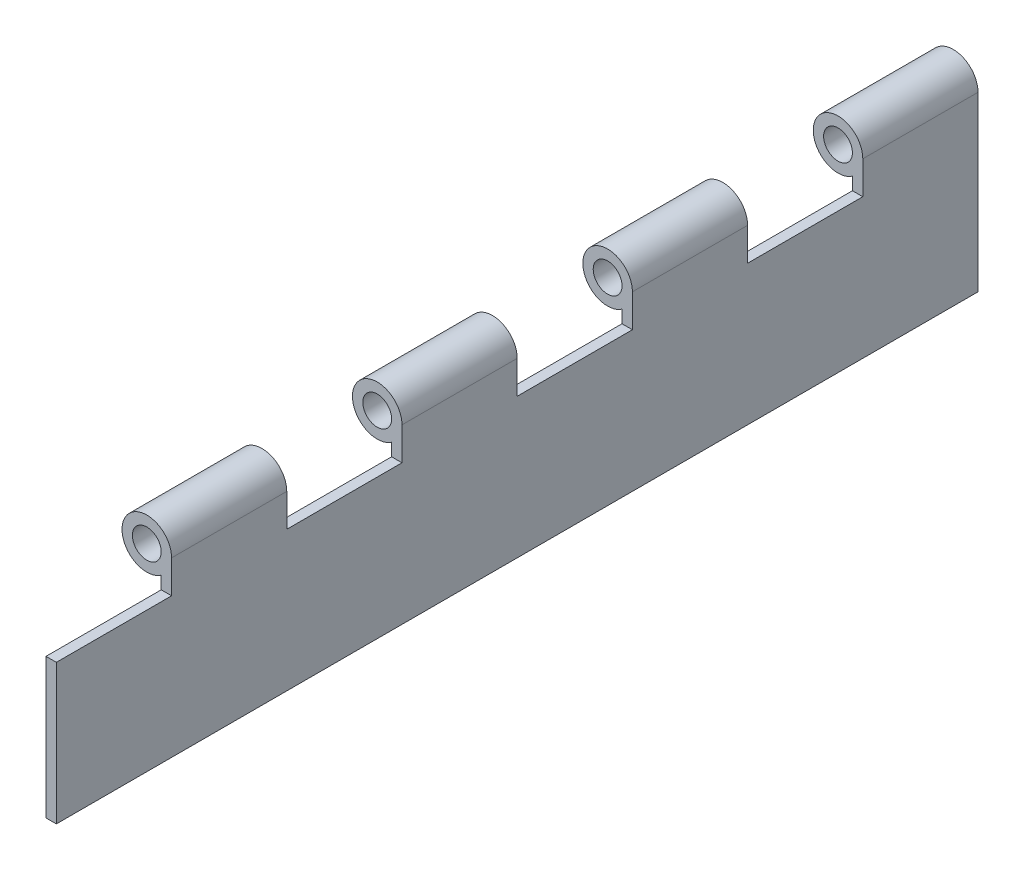
ISO-10303-21;
HEADER;
FILE_DESCRIPTION(('STEP AP214'),'2;1');
FILE_NAME('part.step','',(''),(''),'','','');
FILE_SCHEMA(('AUTOMOTIVE_DESIGN { 1 0 10303 214 1 1 1 1 }'));
ENDSEC;
DATA;
#1=APPLICATION_CONTEXT('core data for automotive mechanical design processes');
#2=APPLICATION_PROTOCOL_DEFINITION('international standard','automotive_design',2000,#1);
#3=PRODUCT_CONTEXT('',#1,'mechanical');
#4=PRODUCT('Part','Part','',(#3));
#5=PRODUCT_RELATED_PRODUCT_CATEGORY('part','',(#4));
#6=PRODUCT_DEFINITION_FORMATION('','',#4);
#7=PRODUCT_DEFINITION_CONTEXT('part definition',#1,'design');
#8=PRODUCT_DEFINITION('design','',#6,#7);
#9=PRODUCT_DEFINITION_SHAPE('','',#8);
#10=(LENGTH_UNIT() NAMED_UNIT(*) SI_UNIT(.MILLI.,.METRE.));
#11=(NAMED_UNIT(*) PLANE_ANGLE_UNIT() SI_UNIT($,.RADIAN.));
#12=(NAMED_UNIT(*) SI_UNIT($,.STERADIAN.) SOLID_ANGLE_UNIT());
#13=UNCERTAINTY_MEASURE_WITH_UNIT(LENGTH_MEASURE(1.E-05),#10,'distance_accuracy_value','');
#14=(GEOMETRIC_REPRESENTATION_CONTEXT(3) GLOBAL_UNCERTAINTY_ASSIGNED_CONTEXT((#13)) GLOBAL_UNIT_ASSIGNED_CONTEXT((#10,
#11,#12)) REPRESENTATION_CONTEXT('',''));
#15=CARTESIAN_POINT('',(0.,0.,0.));
#16=DIRECTION('',(0.,0.,1.));
#17=DIRECTION('',(1.,0.,0.));
#18=AXIS2_PLACEMENT_3D('',#15,#16,#17);
#19=CARTESIAN_POINT('',(0.,0.,203.2));
#20=DIRECTION('',(0.,0.,-1.));
#21=DIRECTION('',(-1.,0.,0.));
#22=AXIS2_PLACEMENT_3D('',#19,#20,#21);
#23=CYLINDRICAL_SURFACE('',#22,5.461);
#24=DIRECTION('',(0.,0.,-1.));
#25=VECTOR('',#24,1.);
#26=CARTESIAN_POINT('',(5.461,0.,203.2));
#27=LINE('',#26,#25);
#28=CARTESIAN_POINT('',(5.461,0.,177.8));
#29=VERTEX_POINT('',#28);
#30=CARTESIAN_POINT('',(5.461,0.,152.4));
#31=VERTEX_POINT('',#30);
#32=EDGE_CURVE('E298',#29,#31,#27,.T.);
#33=ORIENTED_EDGE('',*,*,#32,.T.);
#34=CARTESIAN_POINT('',(0.,0.,152.4));
#35=DIRECTION('',(0.,0.,1.));
#36=DIRECTION('',(1.,0.,0.));
#37=AXIS2_PLACEMENT_3D('',#34,#35,#36);
#38=CIRCLE('',#37,5.461);
#39=CARTESIAN_POINT('',(3.17500000000001,-4.44318534387211,152.4));
#40=VERTEX_POINT('',#39);
#41=EDGE_CURVE('E248',#31,#40,#38,.T.);
#42=ORIENTED_EDGE('',*,*,#41,.T.);
#43=DIRECTION('',(0.,0.,-1.));
#44=VECTOR('',#43,1.);
#45=CARTESIAN_POINT('',(3.17500000000001,-4.44318534387211,203.2));
#46=LINE('',#45,#44);
#47=CARTESIAN_POINT('',(3.17500000000001,-4.44318534387211,177.8));
#48=VERTEX_POINT('',#47);
#49=EDGE_CURVE('E11',#48,#40,#46,.T.);
#50=ORIENTED_EDGE('',*,*,#49,.F.);
#51=CARTESIAN_POINT('',(0.,0.,177.8));
#52=DIRECTION('',(0.,0.,-1.));
#53=DIRECTION('',(-1.,0.,0.));
#54=AXIS2_PLACEMENT_3D('',#51,#52,#53);
#55=CIRCLE('',#54,5.461);
#56=EDGE_CURVE('E272',#48,#29,#55,.T.);
#57=ORIENTED_EDGE('',*,*,#56,.T.);
#58=EDGE_LOOP('',(#33,#42,#50,#57));
#59=FACE_BOUND('',#58,.T.);
#60=ADVANCED_FACE('F39',(#59),#23,.T.);
#61=CARTESIAN_POINT('',(3.17500000000001,-4.44318534387211,127.));
#62=VERTEX_POINT('',#61);
#63=CARTESIAN_POINT('',(3.17500000000001,-4.44318534387211,101.6));
#64=VERTEX_POINT('',#63);
#65=EDGE_CURVE('E48',#62,#64,#46,.T.);
#66=ORIENTED_EDGE('',*,*,#65,.F.);
#67=CARTESIAN_POINT('',(0.,0.,127.));
#68=DIRECTION('',(0.,0.,-1.));
#69=DIRECTION('',(-1.,0.,0.));
#70=AXIS2_PLACEMENT_3D('',#67,#68,#69);
#71=CIRCLE('',#70,5.461);
#72=CARTESIAN_POINT('',(5.461,0.,127.));
#73=VERTEX_POINT('',#72);
#74=EDGE_CURVE('E243',#62,#73,#71,.T.);
#75=ORIENTED_EDGE('',*,*,#74,.T.);
#76=CARTESIAN_POINT('',(5.461,0.,101.6));
#77=VERTEX_POINT('',#76);
#78=EDGE_CURVE('E189',#73,#77,#27,.T.);
#79=ORIENTED_EDGE('',*,*,#78,.T.);
#80=CARTESIAN_POINT('',(0.,0.,101.6));
#81=DIRECTION('',(0.,0.,1.));
#82=DIRECTION('',(1.,0.,0.));
#83=AXIS2_PLACEMENT_3D('',#80,#81,#82);
#84=CIRCLE('',#83,5.461);
#85=EDGE_CURVE('E239',#77,#64,#84,.T.);
#86=ORIENTED_EDGE('',*,*,#85,.T.);
#87=EDGE_LOOP('',(#66,#75,#79,#86));
#88=FACE_BOUND('',#87,.T.);
#89=ADVANCED_FACE('F343',(#88),#23,.T.);
#90=CARTESIAN_POINT('',(3.17500000000001,-4.44318534387211,76.2));
#91=VERTEX_POINT('',#90);
#92=CARTESIAN_POINT('',(3.17500000000001,-4.44318534387211,50.8));
#93=VERTEX_POINT('',#92);
#94=EDGE_CURVE('E374',#91,#93,#46,.T.);
#95=ORIENTED_EDGE('',*,*,#94,.F.);
#96=CARTESIAN_POINT('',(0.,0.,76.2));
#97=DIRECTION('',(0.,0.,-1.));
#98=DIRECTION('',(-1.,0.,0.));
#99=AXIS2_PLACEMENT_3D('',#96,#97,#98);
#100=CIRCLE('',#99,5.461);
#101=CARTESIAN_POINT('',(5.461,0.,76.2));
#102=VERTEX_POINT('',#101);
#103=EDGE_CURVE('E233',#91,#102,#100,.T.);
#104=ORIENTED_EDGE('',*,*,#103,.T.);
#105=CARTESIAN_POINT('',(5.461,0.,50.8));
#106=VERTEX_POINT('',#105);
#107=EDGE_CURVE('E386',#102,#106,#27,.T.);
#108=ORIENTED_EDGE('',*,*,#107,.T.);
#109=CARTESIAN_POINT('',(0.,0.,50.8));
#110=DIRECTION('',(0.,0.,1.));
#111=DIRECTION('',(1.,0.,0.));
#112=AXIS2_PLACEMENT_3D('',#109,#110,#111);
#113=CIRCLE('',#112,5.461);
#114=EDGE_CURVE('E227',#106,#93,#113,.T.);
#115=ORIENTED_EDGE('',*,*,#114,.T.);
#116=EDGE_LOOP('',(#95,#104,#108,#115));
#117=FACE_BOUND('',#116,.T.);
#118=ADVANCED_FACE('F349',(#117),#23,.T.);
#119=CARTESIAN_POINT('',(0.,0.,203.2));
#120=DIRECTION('',(0.,0.,-1.));
#121=DIRECTION('',(-1.,0.,0.));
#122=AXIS2_PLACEMENT_3D('',#119,#120,#121);
#123=CYLINDRICAL_SURFACE('',#122,3.175);
#124=CARTESIAN_POINT('',(0.,0.,152.4));
#125=DIRECTION('',(0.,0.,1.));
#126=DIRECTION('',(1.,0.,0.));
#127=AXIS2_PLACEMENT_3D('',#124,#125,#126);
#128=CIRCLE('',#127,3.175);
#129=CARTESIAN_POINT('',(3.175,0.,152.4));
#130=VERTEX_POINT('',#129);
#131=EDGE_CURVE('E43',#130,#130,#128,.T.);
#132=ORIENTED_EDGE('',*,*,#131,.F.);
#133=EDGE_LOOP('',(#132));
#134=FACE_BOUND('',#133,.T.);
#135=CARTESIAN_POINT('',(0.,0.,177.8));
#136=DIRECTION('',(0.,0.,-1.));
#137=DIRECTION('',(-1.,0.,0.));
#138=AXIS2_PLACEMENT_3D('',#135,#136,#137);
#139=CIRCLE('',#138,3.175);
#140=CARTESIAN_POINT('',(-3.175,0.,177.8));
#141=VERTEX_POINT('',#140);
#142=EDGE_CURVE('E267',#141,#141,#139,.T.);
#143=ORIENTED_EDGE('',*,*,#142,.F.);
#144=EDGE_LOOP('',(#143));
#145=FACE_BOUND('',#144,.T.);
#146=ADVANCED_FACE('F326',(#134,#145),#123,.F.);
#147=CARTESIAN_POINT('',(0.,0.,203.2));
#148=DIRECTION('',(0.,0.,1.));
#149=DIRECTION('',(1.,0.,0.));
#150=AXIS2_PLACEMENT_3D('',#147,#148,#149);
#151=PLANE('',#150);
#152=DIRECTION('',(1.,0.,0.));
#153=VECTOR('',#152,1.);
#154=CARTESIAN_POINT('',(-5.461,-7.239,203.2));
#155=LINE('',#154,#153);
#156=CARTESIAN_POINT('',(3.17500000000001,-7.239,203.2));
#157=VERTEX_POINT('',#156);
#158=CARTESIAN_POINT('',(5.461,-7.239,203.2));
#159=VERTEX_POINT('',#158);
#160=EDGE_CURVE('E264',#157,#159,#155,.T.);
#161=ORIENTED_EDGE('',*,*,#160,.F.);
#162=DIRECTION('',(0.,-1.,0.));
#163=VECTOR('',#162,1.);
#164=CARTESIAN_POINT('',(3.17500000000001,-38.1,203.2));
#165=LINE('',#164,#163);
#166=CARTESIAN_POINT('',(3.17500000000001,-38.1,203.2));
#167=VERTEX_POINT('',#166);
#168=EDGE_CURVE('E281',#157,#167,#165,.T.);
#169=ORIENTED_EDGE('',*,*,#168,.T.);
#170=DIRECTION('',(1.,0.,0.));
#171=VECTOR('',#170,1.);
#172=CARTESIAN_POINT('',(5.461,-38.1,203.2));
#173=LINE('',#172,#171);
#174=CARTESIAN_POINT('',(5.461,-38.1,203.2));
#175=VERTEX_POINT('',#174);
#176=EDGE_CURVE('E283',#167,#175,#173,.T.);
#177=ORIENTED_EDGE('',*,*,#176,.T.);
#178=DIRECTION('',(0.,1.,0.));
#179=VECTOR('',#178,1.);
#180=CARTESIAN_POINT('',(5.461,0.,203.2));
#181=LINE('',#180,#179);
#182=EDGE_CURVE('E286',#175,#159,#181,.T.);
#183=ORIENTED_EDGE('',*,*,#182,.T.);
#184=EDGE_LOOP('',(#161,#169,#177,#183));
#185=FACE_BOUND('',#184,.T.);
#186=ADVANCED_FACE('F362',(#185),#151,.T.);
#187=CARTESIAN_POINT('',(0.,0.,0.));
#188=DIRECTION('',(0.,0.,1.));
#189=DIRECTION('',(1.,0.,0.));
#190=AXIS2_PLACEMENT_3D('',#187,#188,#189);
#191=PLANE('',#190);
#192=CARTESIAN_POINT('',(0.,0.,0.));
#193=DIRECTION('',(0.,0.,1.));
#194=DIRECTION('',(1.,0.,0.));
#195=AXIS2_PLACEMENT_3D('',#192,#193,#194);
#196=CIRCLE('',#195,5.461);
#197=CARTESIAN_POINT('',(5.461,0.,0.));
#198=VERTEX_POINT('',#197);
#199=CARTESIAN_POINT('',(3.17500000000001,-4.44318534387211,0.));
#200=VERTEX_POINT('',#199);
#201=EDGE_CURVE('E280',#198,#200,#196,.T.);
#202=ORIENTED_EDGE('',*,*,#201,.F.);
#203=DIRECTION('',(0.,1.,0.));
#204=VECTOR('',#203,1.);
#205=CARTESIAN_POINT('',(5.461,0.,0.));
#206=LINE('',#205,#204);
#207=CARTESIAN_POINT('',(5.461,-38.1,0.));
#208=VERTEX_POINT('',#207);
#209=EDGE_CURVE('E284',#208,#198,#206,.T.);
#210=ORIENTED_EDGE('',*,*,#209,.F.);
#211=DIRECTION('',(1.,0.,0.));
#212=VECTOR('',#211,1.);
#213=CARTESIAN_POINT('',(5.461,-38.1,0.));
#214=LINE('',#213,#212);
#215=CARTESIAN_POINT('',(3.17500000000001,-38.1,0.));
#216=VERTEX_POINT('',#215);
#217=EDGE_CURVE('E294',#216,#208,#214,.T.);
#218=ORIENTED_EDGE('',*,*,#217,.F.);
#219=DIRECTION('',(0.,-1.,0.));
#220=VECTOR('',#219,1.);
#221=CARTESIAN_POINT('',(3.17500000000001,-38.1,0.));
#222=LINE('',#221,#220);
#223=EDGE_CURVE('E292',#200,#216,#222,.T.);
#224=ORIENTED_EDGE('',*,*,#223,.F.);
#225=EDGE_LOOP('',(#202,#210,#218,#224));
#226=FACE_BOUND('',#225,.T.);
#227=CARTESIAN_POINT('',(0.,0.,0.));
#228=DIRECTION('',(0.,0.,1.));
#229=DIRECTION('',(1.,0.,0.));
#230=AXIS2_PLACEMENT_3D('',#227,#228,#229);
#231=CIRCLE('',#230,3.175);
#232=CARTESIAN_POINT('',(3.175,0.,0.));
#233=VERTEX_POINT('',#232);
#234=EDGE_CURVE('E277',#233,#233,#231,.T.);
#235=ORIENTED_EDGE('',*,*,#234,.T.);
#236=EDGE_LOOP('',(#235));
#237=FACE_BOUND('',#236,.T.);
#238=ADVANCED_FACE('F353',(#226,#237),#191,.F.);
#239=CARTESIAN_POINT('',(3.17500000000001,-4.44318534387211,25.4));
#240=VERTEX_POINT('',#239);
#241=EDGE_CURVE('E50',#240,#200,#46,.T.);
#242=ORIENTED_EDGE('',*,*,#241,.F.);
#243=CARTESIAN_POINT('',(0.,0.,25.4));
#244=DIRECTION('',(0.,0.,-1.));
#245=DIRECTION('',(-1.,0.,0.));
#246=AXIS2_PLACEMENT_3D('',#243,#244,#245);
#247=CIRCLE('',#246,5.461);
#248=CARTESIAN_POINT('',(5.461,0.,25.4));
#249=VERTEX_POINT('',#248);
#250=EDGE_CURVE('E221',#240,#249,#247,.T.);
#251=ORIENTED_EDGE('',*,*,#250,.T.);
#252=EDGE_CURVE('E289',#249,#198,#27,.T.);
#253=ORIENTED_EDGE('',*,*,#252,.T.);
#254=ORIENTED_EDGE('',*,*,#201,.T.);
#255=EDGE_LOOP('',(#242,#251,#253,#254));
#256=FACE_BOUND('',#255,.T.);
#257=ADVANCED_FACE('F41',(#256),#23,.T.);
#258=CARTESIAN_POINT('',(3.17500000000001,-38.1,203.2));
#259=DIRECTION('',(1.,0.,0.));
#260=DIRECTION('',(0.,1.,0.));
#261=AXIS2_PLACEMENT_3D('',#258,#259,#260);
#262=PLANE('',#261);
#263=ORIENTED_EDGE('',*,*,#49,.T.);
#264=DIRECTION('',(0.,-1.,0.));
#265=VECTOR('',#264,1.);
#266=CARTESIAN_POINT('',(3.17500000000001,-38.1,152.4));
#267=LINE('',#266,#265);
#268=CARTESIAN_POINT('',(3.17500000000001,-7.239,152.4));
#269=VERTEX_POINT('',#268);
#270=EDGE_CURVE('E245',#40,#269,#267,.T.);
#271=ORIENTED_EDGE('',*,*,#270,.T.);
#272=DIRECTION('',(0.,0.,-1.));
#273=VECTOR('',#272,1.);
#274=CARTESIAN_POINT('',(3.17500000000001,-7.239,203.2));
#275=LINE('',#274,#273);
#276=CARTESIAN_POINT('',(3.17500000000001,-7.239,127.));
#277=VERTEX_POINT('',#276);
#278=EDGE_CURVE('E256',#269,#277,#275,.T.);
#279=ORIENTED_EDGE('',*,*,#278,.T.);
#280=DIRECTION('',(0.,1.,0.));
#281=VECTOR('',#280,1.);
#282=CARTESIAN_POINT('',(3.17500000000001,-38.1,127.));
#283=LINE('',#282,#281);
#284=EDGE_CURVE('E176',#277,#62,#283,.T.);
#285=ORIENTED_EDGE('',*,*,#284,.T.);
#286=ORIENTED_EDGE('',*,*,#65,.T.);
#287=DIRECTION('',(0.,-1.,0.));
#288=VECTOR('',#287,1.);
#289=CARTESIAN_POINT('',(3.17500000000001,-38.1,101.6));
#290=LINE('',#289,#288);
#291=CARTESIAN_POINT('',(3.17500000000001,-7.239,101.6));
#292=VERTEX_POINT('',#291);
#293=EDGE_CURVE('E236',#64,#292,#290,.T.);
#294=ORIENTED_EDGE('',*,*,#293,.T.);
#295=DIRECTION('',(0.,0.,-1.));
#296=VECTOR('',#295,1.);
#297=CARTESIAN_POINT('',(3.17500000000001,-7.239,203.2));
#298=LINE('',#297,#296);
#299=CARTESIAN_POINT('',(3.17500000000001,-7.239,76.2));
#300=VERTEX_POINT('',#299);
#301=EDGE_CURVE('E253',#292,#300,#298,.T.);
#302=ORIENTED_EDGE('',*,*,#301,.T.);
#303=DIRECTION('',(0.,1.,0.));
#304=VECTOR('',#303,1.);
#305=CARTESIAN_POINT('',(3.17500000000001,-38.1,76.2));
#306=LINE('',#305,#304);
#307=EDGE_CURVE('E230',#300,#91,#306,.T.);
#308=ORIENTED_EDGE('',*,*,#307,.T.);
#309=ORIENTED_EDGE('',*,*,#94,.T.);
#310=DIRECTION('',(0.,-1.,0.));
#311=VECTOR('',#310,1.);
#312=CARTESIAN_POINT('',(3.17500000000001,-38.1,50.8));
#313=LINE('',#312,#311);
#314=CARTESIAN_POINT('',(3.17500000000001,-7.239,50.8));
#315=VERTEX_POINT('',#314);
#316=EDGE_CURVE('E224',#93,#315,#313,.T.);
#317=ORIENTED_EDGE('',*,*,#316,.T.);
#318=DIRECTION('',(0.,0.,-1.));
#319=VECTOR('',#318,1.);
#320=CARTESIAN_POINT('',(3.17500000000001,-7.239,203.2));
#321=LINE('',#320,#319);
#322=CARTESIAN_POINT('',(3.17500000000001,-7.239,25.4));
#323=VERTEX_POINT('',#322);
#324=EDGE_CURVE('E250',#315,#323,#321,.T.);
#325=ORIENTED_EDGE('',*,*,#324,.T.);
#326=DIRECTION('',(0.,1.,0.));
#327=VECTOR('',#326,1.);
#328=CARTESIAN_POINT('',(3.17500000000001,-38.1,25.4));
#329=LINE('',#328,#327);
#330=EDGE_CURVE('E218',#323,#240,#329,.T.);
#331=ORIENTED_EDGE('',*,*,#330,.T.);
#332=ORIENTED_EDGE('',*,*,#241,.T.);
#333=ORIENTED_EDGE('',*,*,#223,.T.);
#334=DIRECTION('',(0.,0.,-1.));
#335=VECTOR('',#334,1.);
#336=CARTESIAN_POINT('',(3.17500000000001,-38.1,203.2));
#337=LINE('',#336,#335);
#338=EDGE_CURVE('E304',#167,#216,#337,.T.);
#339=ORIENTED_EDGE('',*,*,#338,.F.);
#340=ORIENTED_EDGE('',*,*,#168,.F.);
#341=DIRECTION('',(0.,0.,-1.));
#342=VECTOR('',#341,1.);
#343=CARTESIAN_POINT('',(3.17500000000001,-7.239,203.2));
#344=LINE('',#343,#342);
#345=CARTESIAN_POINT('',(3.17500000000001,-7.239,177.8));
#346=VERTEX_POINT('',#345);
#347=EDGE_CURVE('E274',#157,#346,#344,.T.);
#348=ORIENTED_EDGE('',*,*,#347,.T.);
#349=DIRECTION('',(0.,1.,0.));
#350=VECTOR('',#349,1.);
#351=CARTESIAN_POINT('',(3.17500000000001,-38.1,177.8));
#352=LINE('',#351,#350);
#353=EDGE_CURVE('E269',#346,#48,#352,.T.);
#354=ORIENTED_EDGE('',*,*,#353,.T.);
#355=EDGE_LOOP('',(#263,#271,#279,#285,#286,#294,#302,#308,#309,#317,#325,#331,#332,#333,#339,
#340,#348,#354));
#356=FACE_BOUND('',#355,.T.);
#357=ADVANCED_FACE('F352',(#356),#262,.F.);
#358=CARTESIAN_POINT('',(5.461,-38.1,203.2));
#359=DIRECTION('',(0.,1.,0.));
#360=DIRECTION('',(0.,0.,1.));
#361=AXIS2_PLACEMENT_3D('',#358,#359,#360);
#362=PLANE('',#361);
#363=ORIENTED_EDGE('',*,*,#217,.T.);
#364=DIRECTION('',(0.,0.,-1.));
#365=VECTOR('',#364,1.);
#366=CARTESIAN_POINT('',(5.461,-38.1,203.2));
#367=LINE('',#366,#365);
#368=EDGE_CURVE('E301',#175,#208,#367,.T.);
#369=ORIENTED_EDGE('',*,*,#368,.F.);
#370=ORIENTED_EDGE('',*,*,#176,.F.);
#371=ORIENTED_EDGE('',*,*,#338,.T.);
#372=EDGE_LOOP('',(#363,#369,#370,#371));
#373=FACE_BOUND('',#372,.T.);
#374=ADVANCED_FACE('F359',(#373),#362,.F.);
#375=CARTESIAN_POINT('',(5.461,0.,203.2));
#376=DIRECTION('',(-1.,0.,0.));
#377=DIRECTION('',(0.,-1.,0.));
#378=AXIS2_PLACEMENT_3D('',#375,#376,#377);
#379=PLANE('',#378);
#380=DIRECTION('',(0.,0.,-1.));
#381=VECTOR('',#380,1.);
#382=CARTESIAN_POINT('',(5.461,-7.239,152.4));
#383=LINE('',#382,#381);
#384=CARTESIAN_POINT('',(5.461,-7.239,152.4));
#385=VERTEX_POINT('',#384);
#386=CARTESIAN_POINT('',(5.461,-7.239,127.));
#387=VERTEX_POINT('',#386);
#388=EDGE_CURVE('E183',#385,#387,#383,.T.);
#389=ORIENTED_EDGE('',*,*,#388,.F.);
#390=DIRECTION('',(0.,-1.,0.));
#391=VECTOR('',#390,1.);
#392=CARTESIAN_POINT('',(5.461,5.461,152.4));
#393=LINE('',#392,#391);
#394=EDGE_CURVE('E57',#31,#385,#393,.T.);
#395=ORIENTED_EDGE('',*,*,#394,.F.);
#396=ORIENTED_EDGE('',*,*,#32,.F.);
#397=DIRECTION('',(0.,1.,0.));
#398=VECTOR('',#397,1.);
#399=CARTESIAN_POINT('',(5.461,5.461,177.8));
#400=LINE('',#399,#398);
#401=CARTESIAN_POINT('',(5.461,-7.239,177.8));
#402=VERTEX_POINT('',#401);
#403=EDGE_CURVE('E261',#402,#29,#400,.T.);
#404=ORIENTED_EDGE('',*,*,#403,.F.);
#405=DIRECTION('',(0.,0.,-1.));
#406=VECTOR('',#405,1.);
#407=CARTESIAN_POINT('',(5.461,-7.239,203.2));
#408=LINE('',#407,#406);
#409=EDGE_CURVE('E258',#159,#402,#408,.T.);
#410=ORIENTED_EDGE('',*,*,#409,.F.);
#411=ORIENTED_EDGE('',*,*,#182,.F.);
#412=ORIENTED_EDGE('',*,*,#368,.T.);
#413=ORIENTED_EDGE('',*,*,#209,.T.);
#414=ORIENTED_EDGE('',*,*,#252,.F.);
#415=DIRECTION('',(0.,1.,0.));
#416=VECTOR('',#415,1.);
#417=CARTESIAN_POINT('',(5.461,5.461,25.4));
#418=LINE('',#417,#416);
#419=CARTESIAN_POINT('',(5.461,-7.239,25.4));
#420=VERTEX_POINT('',#419);
#421=EDGE_CURVE('E211',#420,#249,#418,.T.);
#422=ORIENTED_EDGE('',*,*,#421,.F.);
#423=DIRECTION('',(0.,0.,-1.));
#424=VECTOR('',#423,1.);
#425=CARTESIAN_POINT('',(5.461,-7.239,50.8));
#426=LINE('',#425,#424);
#427=CARTESIAN_POINT('',(5.461,-7.239,50.8));
#428=VERTEX_POINT('',#427);
#429=EDGE_CURVE('E208',#428,#420,#426,.T.);
#430=ORIENTED_EDGE('',*,*,#429,.F.);
#431=DIRECTION('',(0.,-1.,0.));
#432=VECTOR('',#431,1.);
#433=CARTESIAN_POINT('',(5.461,5.461,50.8));
#434=LINE('',#433,#432);
#435=EDGE_CURVE('E206',#106,#428,#434,.T.);
#436=ORIENTED_EDGE('',*,*,#435,.F.);
#437=ORIENTED_EDGE('',*,*,#107,.F.);
#438=DIRECTION('',(0.,1.,0.));
#439=VECTOR('',#438,1.);
#440=CARTESIAN_POINT('',(5.461,5.461,76.2));
#441=LINE('',#440,#439);
#442=CARTESIAN_POINT('',(5.461,-7.239,76.2));
#443=VERTEX_POINT('',#442);
#444=EDGE_CURVE('E199',#443,#102,#441,.T.);
#445=ORIENTED_EDGE('',*,*,#444,.F.);
#446=DIRECTION('',(0.,0.,-1.));
#447=VECTOR('',#446,1.);
#448=CARTESIAN_POINT('',(5.461,-7.239,101.6));
#449=LINE('',#448,#447);
#450=CARTESIAN_POINT('',(5.461,-7.239,101.6));
#451=VERTEX_POINT('',#450);
#452=EDGE_CURVE('E195',#451,#443,#449,.T.);
#453=ORIENTED_EDGE('',*,*,#452,.F.);
#454=DIRECTION('',(0.,-1.,0.));
#455=VECTOR('',#454,1.);
#456=CARTESIAN_POINT('',(5.461,5.461,101.6));
#457=LINE('',#456,#455);
#458=EDGE_CURVE('E65',#77,#451,#457,.T.);
#459=ORIENTED_EDGE('',*,*,#458,.F.);
#460=ORIENTED_EDGE('',*,*,#78,.F.);
#461=DIRECTION('',(0.,1.,0.));
#462=VECTOR('',#461,1.);
#463=CARTESIAN_POINT('',(5.461,5.461,127.));
#464=LINE('',#463,#462);
#465=EDGE_CURVE('E173',#387,#73,#464,.T.);
#466=ORIENTED_EDGE('',*,*,#465,.F.);
#467=EDGE_LOOP('',(#389,#395,#396,#404,#410,#411,#412,#413,#414,#422,#430,#436,#437,#445,#453,
#459,#460,#466));
#468=FACE_BOUND('',#467,.T.);
#469=ADVANCED_FACE('F187',(#468),#379,.F.);
#470=CARTESIAN_POINT('',(0.,0.,25.4));
#471=DIRECTION('',(0.,0.,-1.));
#472=DIRECTION('',(-1.,0.,0.));
#473=AXIS2_PLACEMENT_3D('',#470,#471,#472);
#474=CIRCLE('',#473,3.175);
#475=CARTESIAN_POINT('',(-3.175,0.,25.4));
#476=VERTEX_POINT('',#475);
#477=EDGE_CURVE('E179',#476,#476,#474,.T.);
#478=ORIENTED_EDGE('',*,*,#477,.F.);
#479=EDGE_LOOP('',(#478));
#480=FACE_BOUND('',#479,.T.);
#481=ORIENTED_EDGE('',*,*,#234,.F.);
#482=EDGE_LOOP('',(#481));
#483=FACE_BOUND('',#482,.T.);
#484=ADVANCED_FACE('F371',(#480,#483),#123,.F.);
#485=CARTESIAN_POINT('',(-5.461,-7.239,203.2));
#486=DIRECTION('',(0.,-1.,0.));
#487=DIRECTION('',(1.,0.,0.));
#488=AXIS2_PLACEMENT_3D('',#485,#486,#487);
#489=PLANE('',#488);
#490=ORIENTED_EDGE('',*,*,#160,.T.);
#491=ORIENTED_EDGE('',*,*,#409,.T.);
#492=DIRECTION('',(1.,0.,0.));
#493=VECTOR('',#492,1.);
#494=CARTESIAN_POINT('',(-5.461,-7.239,177.8));
#495=LINE('',#494,#493);
#496=EDGE_CURVE('E265',#346,#402,#495,.T.);
#497=ORIENTED_EDGE('',*,*,#496,.F.);
#498=ORIENTED_EDGE('',*,*,#347,.F.);
#499=EDGE_LOOP('',(#490,#491,#497,#498));
#500=FACE_BOUND('',#499,.T.);
#501=ADVANCED_FACE('F396',(#500),#489,.F.);
#502=CARTESIAN_POINT('',(-5.461,5.461,177.8));
#503=DIRECTION('',(0.,0.,-1.));
#504=DIRECTION('',(-1.,0.,0.));
#505=AXIS2_PLACEMENT_3D('',#502,#503,#504);
#506=PLANE('',#505);
#507=ORIENTED_EDGE('',*,*,#142,.T.);
#508=EDGE_LOOP('',(#507));
#509=FACE_BOUND('',#508,.T.);
#510=ORIENTED_EDGE('',*,*,#56,.F.);
#511=ORIENTED_EDGE('',*,*,#353,.F.);
#512=ORIENTED_EDGE('',*,*,#496,.T.);
#513=ORIENTED_EDGE('',*,*,#403,.T.);
#514=EDGE_LOOP('',(#510,#511,#512,#513));
#515=FACE_BOUND('',#514,.T.);
#516=ADVANCED_FACE('F401',(#509,#515),#506,.F.);
#517=CARTESIAN_POINT('',(-5.46100000000001,-7.239,50.8));
#518=DIRECTION('',(0.,-1.,0.));
#519=DIRECTION('',(1.,0.,0.));
#520=AXIS2_PLACEMENT_3D('',#517,#518,#519);
#521=PLANE('',#520);
#522=DIRECTION('',(1.,0.,0.));
#523=VECTOR('',#522,1.);
#524=CARTESIAN_POINT('',(-5.46100000000001,-7.239,50.8));
#525=LINE('',#524,#523);
#526=EDGE_CURVE('E214',#315,#428,#525,.T.);
#527=ORIENTED_EDGE('',*,*,#526,.T.);
#528=ORIENTED_EDGE('',*,*,#429,.T.);
#529=DIRECTION('',(1.,0.,0.));
#530=VECTOR('',#529,1.);
#531=CARTESIAN_POINT('',(-5.46100000000001,-7.239,25.4));
#532=LINE('',#531,#530);
#533=EDGE_CURVE('E196',#323,#420,#532,.T.);
#534=ORIENTED_EDGE('',*,*,#533,.F.);
#535=ORIENTED_EDGE('',*,*,#324,.F.);
#536=EDGE_LOOP('',(#527,#528,#534,#535));
#537=FACE_BOUND('',#536,.T.);
#538=ADVANCED_FACE('F418',(#537),#521,.F.);
#539=CARTESIAN_POINT('',(-5.46100000000001,5.461,50.8));
#540=DIRECTION('',(0.,0.,1.));
#541=DIRECTION('',(1.,0.,0.));
#542=AXIS2_PLACEMENT_3D('',#539,#540,#541);
#543=PLANE('',#542);
#544=CARTESIAN_POINT('',(0.,0.,50.8));
#545=DIRECTION('',(0.,0.,1.));
#546=DIRECTION('',(1.,0.,0.));
#547=AXIS2_PLACEMENT_3D('',#544,#545,#546);
#548=CIRCLE('',#547,3.175);
#549=CARTESIAN_POINT('',(3.175,0.,50.8));
#550=VERTEX_POINT('',#549);
#551=EDGE_CURVE('E223',#550,#550,#548,.T.);
#552=ORIENTED_EDGE('',*,*,#551,.T.);
#553=EDGE_LOOP('',(#552));
#554=FACE_BOUND('',#553,.T.);
#555=ORIENTED_EDGE('',*,*,#435,.T.);
#556=ORIENTED_EDGE('',*,*,#526,.F.);
#557=ORIENTED_EDGE('',*,*,#316,.F.);
#558=ORIENTED_EDGE('',*,*,#114,.F.);
#559=EDGE_LOOP('',(#555,#556,#557,#558));
#560=FACE_BOUND('',#559,.T.);
#561=ADVANCED_FACE('F416',(#554,#560),#543,.F.);
#562=CARTESIAN_POINT('',(-5.46100000000001,5.461,25.4));
#563=DIRECTION('',(0.,0.,-1.));
#564=DIRECTION('',(-1.,0.,0.));
#565=AXIS2_PLACEMENT_3D('',#562,#563,#564);
#566=PLANE('',#565);
#567=ORIENTED_EDGE('',*,*,#477,.T.);
#568=EDGE_LOOP('',(#567));
#569=FACE_BOUND('',#568,.T.);
#570=ORIENTED_EDGE('',*,*,#250,.F.);
#571=ORIENTED_EDGE('',*,*,#330,.F.);
#572=ORIENTED_EDGE('',*,*,#533,.T.);
#573=ORIENTED_EDGE('',*,*,#421,.T.);
#574=EDGE_LOOP('',(#570,#571,#572,#573));
#575=FACE_BOUND('',#574,.T.);
#576=ADVANCED_FACE('F421',(#569,#575),#566,.F.);
#577=CARTESIAN_POINT('',(0.,0.,76.2));
#578=DIRECTION('',(0.,0.,-1.));
#579=DIRECTION('',(-1.,0.,0.));
#580=AXIS2_PLACEMENT_3D('',#577,#578,#579);
#581=CIRCLE('',#580,3.175);
#582=CARTESIAN_POINT('',(-3.175,0.,76.2));
#583=VERTEX_POINT('',#582);
#584=EDGE_CURVE('E229',#583,#583,#581,.T.);
#585=ORIENTED_EDGE('',*,*,#584,.F.);
#586=EDGE_LOOP('',(#585));
#587=FACE_BOUND('',#586,.T.);
#588=ORIENTED_EDGE('',*,*,#551,.F.);
#589=EDGE_LOOP('',(#588));
#590=FACE_BOUND('',#589,.T.);
#591=ADVANCED_FACE('F325',(#587,#590),#123,.F.);
#592=CARTESIAN_POINT('',(-5.46100000000001,-7.239,101.6));
#593=DIRECTION('',(0.,-1.,0.));
#594=DIRECTION('',(1.,0.,0.));
#595=AXIS2_PLACEMENT_3D('',#592,#593,#594);
#596=PLANE('',#595);
#597=DIRECTION('',(1.,0.,0.));
#598=VECTOR('',#597,1.);
#599=CARTESIAN_POINT('',(-5.46100000000001,-7.239,101.6));
#600=LINE('',#599,#598);
#601=EDGE_CURVE('E202',#292,#451,#600,.T.);
#602=ORIENTED_EDGE('',*,*,#601,.T.);
#603=ORIENTED_EDGE('',*,*,#452,.T.);
#604=DIRECTION('',(1.,0.,0.));
#605=VECTOR('',#604,1.);
#606=CARTESIAN_POINT('',(-5.46100000000001,-7.239,76.2));
#607=LINE('',#606,#605);
#608=EDGE_CURVE('E203',#300,#443,#607,.T.);
#609=ORIENTED_EDGE('',*,*,#608,.F.);
#610=ORIENTED_EDGE('',*,*,#301,.F.);
#611=EDGE_LOOP('',(#602,#603,#609,#610));
#612=FACE_BOUND('',#611,.T.);
#613=ADVANCED_FACE('F331',(#612),#596,.F.);
#614=CARTESIAN_POINT('',(-5.46100000000001,5.461,101.6));
#615=DIRECTION('',(0.,0.,1.));
#616=DIRECTION('',(1.,0.,0.));
#617=AXIS2_PLACEMENT_3D('',#614,#615,#616);
#618=PLANE('',#617);
#619=CARTESIAN_POINT('',(0.,0.,101.6));
#620=DIRECTION('',(0.,0.,1.));
#621=DIRECTION('',(1.,0.,0.));
#622=AXIS2_PLACEMENT_3D('',#619,#620,#621);
#623=CIRCLE('',#622,3.175);
#624=CARTESIAN_POINT('',(3.175,0.,101.6));
#625=VERTEX_POINT('',#624);
#626=EDGE_CURVE('E235',#625,#625,#623,.T.);
#627=ORIENTED_EDGE('',*,*,#626,.T.);
#628=EDGE_LOOP('',(#627));
#629=FACE_BOUND('',#628,.T.);
#630=ORIENTED_EDGE('',*,*,#458,.T.);
#631=ORIENTED_EDGE('',*,*,#601,.F.);
#632=ORIENTED_EDGE('',*,*,#293,.F.);
#633=ORIENTED_EDGE('',*,*,#85,.F.);
#634=EDGE_LOOP('',(#630,#631,#632,#633));
#635=FACE_BOUND('',#634,.T.);
#636=ADVANCED_FACE('F329',(#629,#635),#618,.F.);
#637=CARTESIAN_POINT('',(-5.46100000000001,5.461,76.2));
#638=DIRECTION('',(0.,0.,-1.));
#639=DIRECTION('',(-1.,0.,0.));
#640=AXIS2_PLACEMENT_3D('',#637,#638,#639);
#641=PLANE('',#640);
#642=ORIENTED_EDGE('',*,*,#584,.T.);
#643=EDGE_LOOP('',(#642));
#644=FACE_BOUND('',#643,.T.);
#645=ORIENTED_EDGE('',*,*,#103,.F.);
#646=ORIENTED_EDGE('',*,*,#307,.F.);
#647=ORIENTED_EDGE('',*,*,#608,.T.);
#648=ORIENTED_EDGE('',*,*,#444,.T.);
#649=EDGE_LOOP('',(#645,#646,#647,#648));
#650=FACE_BOUND('',#649,.T.);
#651=ADVANCED_FACE('F323',(#644,#650),#641,.F.);
#652=CARTESIAN_POINT('',(0.,0.,127.));
#653=DIRECTION('',(0.,0.,-1.));
#654=DIRECTION('',(-1.,0.,0.));
#655=AXIS2_PLACEMENT_3D('',#652,#653,#654);
#656=CIRCLE('',#655,3.175);
#657=CARTESIAN_POINT('',(-3.175,0.,127.));
#658=VERTEX_POINT('',#657);
#659=EDGE_CURVE('E241',#658,#658,#656,.T.);
#660=ORIENTED_EDGE('',*,*,#659,.F.);
#661=EDGE_LOOP('',(#660));
#662=FACE_BOUND('',#661,.T.);
#663=ORIENTED_EDGE('',*,*,#626,.F.);
#664=EDGE_LOOP('',(#663));
#665=FACE_BOUND('',#664,.T.);
#666=ADVANCED_FACE('F320',(#662,#665),#123,.F.);
#667=CARTESIAN_POINT('',(-5.46100000000001,-7.239,152.4));
#668=DIRECTION('',(0.,-1.,0.));
#669=DIRECTION('',(1.,0.,0.));
#670=AXIS2_PLACEMENT_3D('',#667,#668,#669);
#671=PLANE('',#670);
#672=DIRECTION('',(1.,0.,0.));
#673=VECTOR('',#672,1.);
#674=CARTESIAN_POINT('',(-5.46100000000001,-7.239,152.4));
#675=LINE('',#674,#673);
#676=EDGE_CURVE('E180',#269,#385,#675,.T.);
#677=ORIENTED_EDGE('',*,*,#676,.T.);
#678=ORIENTED_EDGE('',*,*,#388,.T.);
#679=DIRECTION('',(1.,0.,0.));
#680=VECTOR('',#679,1.);
#681=CARTESIAN_POINT('',(-5.46100000000001,-7.239,127.));
#682=LINE('',#681,#680);
#683=EDGE_CURVE('E169',#277,#387,#682,.T.);
#684=ORIENTED_EDGE('',*,*,#683,.F.);
#685=ORIENTED_EDGE('',*,*,#278,.F.);
#686=EDGE_LOOP('',(#677,#678,#684,#685));
#687=FACE_BOUND('',#686,.T.);
#688=ADVANCED_FACE('F184',(#687),#671,.F.);
#689=CARTESIAN_POINT('',(-5.46100000000001,5.461,152.4));
#690=DIRECTION('',(0.,0.,1.));
#691=DIRECTION('',(1.,0.,0.));
#692=AXIS2_PLACEMENT_3D('',#689,#690,#691);
#693=PLANE('',#692);
#694=ORIENTED_EDGE('',*,*,#131,.T.);
#695=EDGE_LOOP('',(#694));
#696=FACE_BOUND('',#695,.T.);
#697=ORIENTED_EDGE('',*,*,#394,.T.);
#698=ORIENTED_EDGE('',*,*,#676,.F.);
#699=ORIENTED_EDGE('',*,*,#270,.F.);
#700=ORIENTED_EDGE('',*,*,#41,.F.);
#701=EDGE_LOOP('',(#697,#698,#699,#700));
#702=FACE_BOUND('',#701,.T.);
#703=ADVANCED_FACE('F404',(#696,#702),#693,.F.);
#704=CARTESIAN_POINT('',(-5.46100000000001,5.461,127.));
#705=DIRECTION('',(0.,0.,-1.));
#706=DIRECTION('',(-1.,0.,0.));
#707=AXIS2_PLACEMENT_3D('',#704,#705,#706);
#708=PLANE('',#707);
#709=ORIENTED_EDGE('',*,*,#659,.T.);
#710=EDGE_LOOP('',(#709));
#711=FACE_BOUND('',#710,.T.);
#712=ORIENTED_EDGE('',*,*,#74,.F.);
#713=ORIENTED_EDGE('',*,*,#284,.F.);
#714=ORIENTED_EDGE('',*,*,#683,.T.);
#715=ORIENTED_EDGE('',*,*,#465,.T.);
#716=EDGE_LOOP('',(#712,#713,#714,#715));
#717=FACE_BOUND('',#716,.T.);
#718=ADVANCED_FACE('F171',(#711,#717),#708,.F.);
#719=CLOSED_SHELL('',(#60,#89,#118,#146,#186,#238,#257,#357,#374,#469,#484,#501,#516,#538,#561,
#576,#591,#613,#636,#651,#666,#688,#703,#718));
#720=MANIFOLD_SOLID_BREP('B2',#719);
#721=ADVANCED_BREP_SHAPE_REPRESENTATION('',(#18,#720),#14);
#722=SHAPE_DEFINITION_REPRESENTATION(#9,#721);
ENDSEC;
END-ISO-10303-21;
